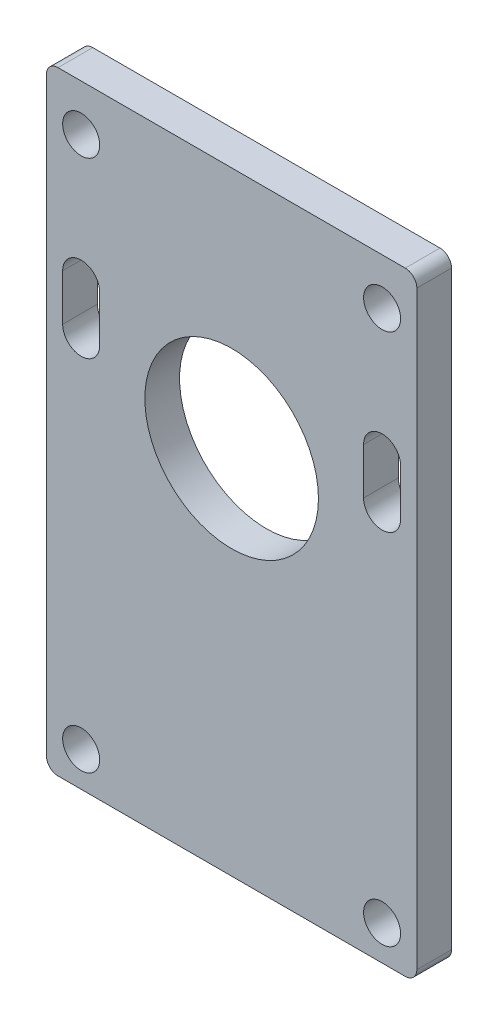
ISO-10303-21;
HEADER;
FILE_DESCRIPTION(('STEP AP214'),'2;1');
FILE_NAME('part.step','',(''),(''),'','','');
FILE_SCHEMA(('AUTOMOTIVE_DESIGN { 1 0 10303 214 1 1 1 1 }'));
ENDSEC;
DATA;
#1=APPLICATION_CONTEXT('core data for automotive mechanical design processes');
#2=APPLICATION_PROTOCOL_DEFINITION('international standard','automotive_design',2000,#1);
#3=PRODUCT_CONTEXT('',#1,'mechanical');
#4=PRODUCT('Part','Part','',(#3));
#5=PRODUCT_RELATED_PRODUCT_CATEGORY('part','',(#4));
#6=PRODUCT_DEFINITION_FORMATION('','',#4);
#7=PRODUCT_DEFINITION_CONTEXT('part definition',#1,'design');
#8=PRODUCT_DEFINITION('design','',#6,#7);
#9=PRODUCT_DEFINITION_SHAPE('','',#8);
#10=(LENGTH_UNIT() NAMED_UNIT(*) SI_UNIT(.MILLI.,.METRE.));
#11=(NAMED_UNIT(*) PLANE_ANGLE_UNIT() SI_UNIT($,.RADIAN.));
#12=(NAMED_UNIT(*) SI_UNIT($,.STERADIAN.) SOLID_ANGLE_UNIT());
#13=UNCERTAINTY_MEASURE_WITH_UNIT(LENGTH_MEASURE(1.E-05),#10,'distance_accuracy_value','');
#14=(GEOMETRIC_REPRESENTATION_CONTEXT(3) GLOBAL_UNCERTAINTY_ASSIGNED_CONTEXT((#13)) GLOBAL_UNIT_ASSIGNED_CONTEXT((#10,
#11,#12)) REPRESENTATION_CONTEXT('',''));
#15=CARTESIAN_POINT('',(0.,0.,0.));
#16=DIRECTION('',(0.,0.,1.));
#17=DIRECTION('',(1.,0.,0.));
#18=AXIS2_PLACEMENT_3D('',#15,#16,#17);
#19=CARTESIAN_POINT('',(0.,0.,3.));
#20=DIRECTION('',(1.,0.,0.));
#21=DIRECTION('',(0.,0.,-1.));
#22=AXIS2_PLACEMENT_3D('',#19,#20,#21);
#23=PLANE('',#22);
#24=DIRECTION('',(0.,-1.,0.));
#25=VECTOR('',#24,1.);
#26=CARTESIAN_POINT('',(0.,0.,0.));
#27=LINE('',#26,#25);
#28=CARTESIAN_POINT('',(0.,52.,0.));
#29=VERTEX_POINT('',#28);
#30=CARTESIAN_POINT('',(0.,1.,0.));
#31=VERTEX_POINT('',#30);
#32=EDGE_CURVE('E260',#29,#31,#27,.T.);
#33=ORIENTED_EDGE('',*,*,#32,.T.);
#34=DIRECTION('',(0.,0.,-1.));
#35=VECTOR('',#34,1.);
#36=CARTESIAN_POINT('',(0.,1.,3.));
#37=LINE('',#36,#35);
#38=CARTESIAN_POINT('',(0.,1.,3.));
#39=VERTEX_POINT('',#38);
#40=EDGE_CURVE('E341',#31,#39,#37,.F.);
#41=ORIENTED_EDGE('',*,*,#40,.T.);
#42=DIRECTION('',(0.,-1.,0.));
#43=VECTOR('',#42,1.);
#44=CARTESIAN_POINT('',(0.,0.,3.));
#45=LINE('',#44,#43);
#46=CARTESIAN_POINT('',(0.,52.,3.));
#47=VERTEX_POINT('',#46);
#48=EDGE_CURVE('E261',#47,#39,#45,.T.);
#49=ORIENTED_EDGE('',*,*,#48,.F.);
#50=DIRECTION('',(0.,0.,-1.));
#51=VECTOR('',#50,1.);
#52=CARTESIAN_POINT('',(0.,52.,3.));
#53=LINE('',#52,#51);
#54=EDGE_CURVE('E337',#47,#29,#53,.T.);
#55=ORIENTED_EDGE('',*,*,#54,.T.);
#56=EDGE_LOOP('',(#33,#41,#49,#55));
#57=FACE_BOUND('',#56,.T.);
#58=ADVANCED_FACE('F41',(#57),#23,.F.);
#59=CARTESIAN_POINT('',(0.,0.,3.));
#60=DIRECTION('',(0.,1.,0.));
#61=DIRECTION('',(0.,0.,1.));
#62=AXIS2_PLACEMENT_3D('',#59,#60,#61);
#63=PLANE('',#62);
#64=DIRECTION('',(1.,0.,0.));
#65=VECTOR('',#64,1.);
#66=CARTESIAN_POINT('',(0.,0.,0.));
#67=LINE('',#66,#65);
#68=CARTESIAN_POINT('',(1.,0.,0.));
#69=VERTEX_POINT('',#68);
#70=CARTESIAN_POINT('',(31.,0.,0.));
#71=VERTEX_POINT('',#70);
#72=EDGE_CURVE('E282',#69,#71,#67,.T.);
#73=ORIENTED_EDGE('',*,*,#72,.T.);
#74=DIRECTION('',(0.,0.,-1.));
#75=VECTOR('',#74,1.);
#76=CARTESIAN_POINT('',(31.,0.,3.));
#77=LINE('',#76,#75);
#78=CARTESIAN_POINT('',(31.,0.,3.));
#79=VERTEX_POINT('',#78);
#80=EDGE_CURVE('E315',#71,#79,#77,.F.);
#81=ORIENTED_EDGE('',*,*,#80,.T.);
#82=DIRECTION('',(1.,0.,0.));
#83=VECTOR('',#82,1.);
#84=CARTESIAN_POINT('',(0.,0.,3.));
#85=LINE('',#84,#83);
#86=CARTESIAN_POINT('',(1.,0.,3.));
#87=VERTEX_POINT('',#86);
#88=EDGE_CURVE('E265',#87,#79,#85,.T.);
#89=ORIENTED_EDGE('',*,*,#88,.F.);
#90=DIRECTION('',(0.,0.,-1.));
#91=VECTOR('',#90,1.);
#92=CARTESIAN_POINT('',(1.,0.,3.));
#93=LINE('',#92,#91);
#94=EDGE_CURVE('E311',#87,#69,#93,.T.);
#95=ORIENTED_EDGE('',*,*,#94,.T.);
#96=EDGE_LOOP('',(#73,#81,#89,#95));
#97=FACE_BOUND('',#96,.T.);
#98=ADVANCED_FACE('F386',(#97),#63,.F.);
#99=CARTESIAN_POINT('',(32.,0.,3.));
#100=DIRECTION('',(-1.,0.,0.));
#101=DIRECTION('',(0.,0.,1.));
#102=AXIS2_PLACEMENT_3D('',#99,#100,#101);
#103=PLANE('',#102);
#104=DIRECTION('',(0.,1.,0.));
#105=VECTOR('',#104,1.);
#106=CARTESIAN_POINT('',(32.,0.,3.));
#107=LINE('',#106,#105);
#108=CARTESIAN_POINT('',(32.,1.,3.));
#109=VERTEX_POINT('',#108);
#110=CARTESIAN_POINT('',(32.,52.,3.));
#111=VERTEX_POINT('',#110);
#112=EDGE_CURVE('E270',#109,#111,#107,.T.);
#113=ORIENTED_EDGE('',*,*,#112,.F.);
#114=DIRECTION('',(0.,0.,-1.));
#115=VECTOR('',#114,1.);
#116=CARTESIAN_POINT('',(32.,1.,3.));
#117=LINE('',#116,#115);
#118=CARTESIAN_POINT('',(32.,1.,0.));
#119=VERTEX_POINT('',#118);
#120=EDGE_CURVE('E295',#109,#119,#117,.T.);
#121=ORIENTED_EDGE('',*,*,#120,.T.);
#122=DIRECTION('',(0.,1.,0.));
#123=VECTOR('',#122,1.);
#124=CARTESIAN_POINT('',(32.,0.,0.));
#125=LINE('',#124,#123);
#126=CARTESIAN_POINT('',(32.,52.,0.));
#127=VERTEX_POINT('',#126);
#128=EDGE_CURVE('E286',#119,#127,#125,.T.);
#129=ORIENTED_EDGE('',*,*,#128,.T.);
#130=DIRECTION('',(0.,0.,-1.));
#131=VECTOR('',#130,1.);
#132=CARTESIAN_POINT('',(32.,52.,3.));
#133=LINE('',#132,#131);
#134=EDGE_CURVE('E278',#127,#111,#133,.F.);
#135=ORIENTED_EDGE('',*,*,#134,.T.);
#136=EDGE_LOOP('',(#113,#121,#129,#135));
#137=FACE_BOUND('',#136,.T.);
#138=ADVANCED_FACE('F392',(#137),#103,.F.);
#139=CARTESIAN_POINT('',(0.,53.,3.));
#140=DIRECTION('',(0.,-1.,0.));
#141=DIRECTION('',(0.,0.,-1.));
#142=AXIS2_PLACEMENT_3D('',#139,#140,#141);
#143=PLANE('',#142);
#144=DIRECTION('',(-1.,0.,0.));
#145=VECTOR('',#144,1.);
#146=CARTESIAN_POINT('',(0.,53.,3.));
#147=LINE('',#146,#145);
#148=CARTESIAN_POINT('',(31.,53.,3.));
#149=VERTEX_POINT('',#148);
#150=CARTESIAN_POINT('',(1.,53.,3.));
#151=VERTEX_POINT('',#150);
#152=EDGE_CURVE('E274',#149,#151,#147,.T.);
#153=ORIENTED_EDGE('',*,*,#152,.F.);
#154=DIRECTION('',(0.,0.,-1.));
#155=VECTOR('',#154,1.);
#156=CARTESIAN_POINT('',(31.,53.,3.));
#157=LINE('',#156,#155);
#158=CARTESIAN_POINT('',(31.,53.,0.));
#159=VERTEX_POINT('',#158);
#160=EDGE_CURVE('E333',#149,#159,#157,.T.);
#161=ORIENTED_EDGE('',*,*,#160,.T.);
#162=DIRECTION('',(-1.,0.,0.));
#163=VECTOR('',#162,1.);
#164=CARTESIAN_POINT('',(0.,53.,0.));
#165=LINE('',#164,#163);
#166=CARTESIAN_POINT('',(1.,53.,0.));
#167=VERTEX_POINT('',#166);
#168=EDGE_CURVE('E266',#159,#167,#165,.T.);
#169=ORIENTED_EDGE('',*,*,#168,.T.);
#170=DIRECTION('',(0.,0.,-1.));
#171=VECTOR('',#170,1.);
#172=CARTESIAN_POINT('',(1.,53.,3.));
#173=LINE('',#172,#171);
#174=EDGE_CURVE('E330',#167,#151,#173,.F.);
#175=ORIENTED_EDGE('',*,*,#174,.T.);
#176=EDGE_LOOP('',(#153,#161,#169,#175));
#177=FACE_BOUND('',#176,.T.);
#178=ADVANCED_FACE('F432',(#177),#143,.F.);
#179=CARTESIAN_POINT('',(0.,0.,3.));
#180=DIRECTION('',(0.,0.,-1.));
#181=DIRECTION('',(-1.,0.,0.));
#182=AXIS2_PLACEMENT_3D('',#179,#180,#181);
#183=PLANE('',#182);
#184=DIRECTION('',(0.,-1.,0.));
#185=VECTOR('',#184,1.);
#186=CARTESIAN_POINT('',(1.4,38.,3.));
#187=LINE('',#186,#185);
#188=CARTESIAN_POINT('',(1.4,38.,3.));
#189=VERTEX_POINT('',#188);
#190=CARTESIAN_POINT('',(1.4,34.,3.));
#191=VERTEX_POINT('',#190);
#192=EDGE_CURVE('E172',#189,#191,#187,.T.);
#193=ORIENTED_EDGE('',*,*,#192,.F.);
#194=CARTESIAN_POINT('',(3.,38.,3.));
#195=DIRECTION('',(0.,0.,1.));
#196=DIRECTION('',(1.,0.,0.));
#197=AXIS2_PLACEMENT_3D('',#194,#195,#196);
#198=CIRCLE('',#197,1.6);
#199=CARTESIAN_POINT('',(4.6,38.,3.));
#200=VERTEX_POINT('',#199);
#201=EDGE_CURVE('E57',#200,#189,#198,.T.);
#202=ORIENTED_EDGE('',*,*,#201,.F.);
#203=DIRECTION('',(0.,1.,0.));
#204=VECTOR('',#203,1.);
#205=CARTESIAN_POINT('',(4.6,38.,3.));
#206=LINE('',#205,#204);
#207=CARTESIAN_POINT('',(4.6,34.,3.));
#208=VERTEX_POINT('',#207);
#209=EDGE_CURVE('E180',#208,#200,#206,.T.);
#210=ORIENTED_EDGE('',*,*,#209,.F.);
#211=CARTESIAN_POINT('',(3.,34.,3.));
#212=DIRECTION('',(0.,0.,1.));
#213=DIRECTION('',(1.,0.,0.));
#214=AXIS2_PLACEMENT_3D('',#211,#212,#213);
#215=CIRCLE('',#214,1.6);
#216=EDGE_CURVE('E161',#191,#208,#215,.T.);
#217=ORIENTED_EDGE('',*,*,#216,.F.);
#218=EDGE_LOOP('',(#193,#202,#210,#217));
#219=FACE_BOUND('',#218,.T.);
#220=DIRECTION('',(0.,-1.,0.));
#221=VECTOR('',#220,1.);
#222=CARTESIAN_POINT('',(27.4,38.,3.));
#223=LINE('',#222,#221);
#224=CARTESIAN_POINT('',(27.4,38.,3.));
#225=VERTEX_POINT('',#224);
#226=CARTESIAN_POINT('',(27.4,34.,3.));
#227=VERTEX_POINT('',#226);
#228=EDGE_CURVE('E197',#225,#227,#223,.T.);
#229=ORIENTED_EDGE('',*,*,#228,.F.);
#230=CARTESIAN_POINT('',(29.,38.,3.));
#231=DIRECTION('',(0.,0.,1.));
#232=DIRECTION('',(-1.,0.,0.));
#233=AXIS2_PLACEMENT_3D('',#230,#231,#232);
#234=CIRCLE('',#233,1.6);
#235=CARTESIAN_POINT('',(30.6,38.,3.));
#236=VERTEX_POINT('',#235);
#237=EDGE_CURVE('E65',#236,#225,#234,.T.);
#238=ORIENTED_EDGE('',*,*,#237,.F.);
#239=DIRECTION('',(0.,1.,0.));
#240=VECTOR('',#239,1.);
#241=CARTESIAN_POINT('',(30.6,38.,3.));
#242=LINE('',#241,#240);
#243=CARTESIAN_POINT('',(30.6,34.,3.));
#244=VERTEX_POINT('',#243);
#245=EDGE_CURVE('E205',#244,#236,#242,.T.);
#246=ORIENTED_EDGE('',*,*,#245,.F.);
#247=CARTESIAN_POINT('',(29.,34.,3.));
#248=DIRECTION('',(0.,0.,1.));
#249=DIRECTION('',(-1.,0.,0.));
#250=AXIS2_PLACEMENT_3D('',#247,#248,#249);
#251=CIRCLE('',#250,1.6);
#252=EDGE_CURVE('E201',#227,#244,#251,.T.);
#253=ORIENTED_EDGE('',*,*,#252,.F.);
#254=EDGE_LOOP('',(#229,#238,#246,#253));
#255=FACE_BOUND('',#254,.T.);
#256=CARTESIAN_POINT('',(16.,32.,3.));
#257=DIRECTION('',(0.,0.,1.));
#258=DIRECTION('',(1.,0.,0.));
#259=AXIS2_PLACEMENT_3D('',#256,#257,#258);
#260=CIRCLE('',#259,7.5);
#261=CARTESIAN_POINT('',(23.5,32.,3.));
#262=VERTEX_POINT('',#261);
#263=EDGE_CURVE('E190',#262,#262,#260,.T.);
#264=ORIENTED_EDGE('',*,*,#263,.F.);
#265=EDGE_LOOP('',(#264));
#266=FACE_BOUND('',#265,.T.);
#267=CARTESIAN_POINT('',(3.,49.,3.));
#268=DIRECTION('',(0.,0.,1.));
#269=DIRECTION('',(1.,0.,0.));
#270=AXIS2_PLACEMENT_3D('',#267,#268,#269);
#271=CIRCLE('',#270,1.6);
#272=CARTESIAN_POINT('',(4.6,49.,3.));
#273=VERTEX_POINT('',#272);
#274=EDGE_CURVE('E225',#273,#273,#271,.T.);
#275=ORIENTED_EDGE('',*,*,#274,.F.);
#276=EDGE_LOOP('',(#275));
#277=FACE_BOUND('',#276,.T.);
#278=CARTESIAN_POINT('',(3.,3.,3.));
#279=DIRECTION('',(0.,0.,1.));
#280=DIRECTION('',(1.,0.,0.));
#281=AXIS2_PLACEMENT_3D('',#278,#279,#280);
#282=CIRCLE('',#281,1.6);
#283=CARTESIAN_POINT('',(4.6,3.,3.));
#284=VERTEX_POINT('',#283);
#285=EDGE_CURVE('E236',#284,#284,#282,.T.);
#286=ORIENTED_EDGE('',*,*,#285,.F.);
#287=EDGE_LOOP('',(#286));
#288=FACE_BOUND('',#287,.T.);
#289=CARTESIAN_POINT('',(29.,49.,3.));
#290=DIRECTION('',(0.,0.,1.));
#291=DIRECTION('',(1.,0.,0.));
#292=AXIS2_PLACEMENT_3D('',#289,#290,#291);
#293=CIRCLE('',#292,1.6);
#294=CARTESIAN_POINT('',(30.6,49.,3.));
#295=VERTEX_POINT('',#294);
#296=EDGE_CURVE('E244',#295,#295,#293,.T.);
#297=ORIENTED_EDGE('',*,*,#296,.F.);
#298=EDGE_LOOP('',(#297));
#299=FACE_BOUND('',#298,.T.);
#300=CARTESIAN_POINT('',(29.,3.,3.));
#301=DIRECTION('',(0.,0.,1.));
#302=DIRECTION('',(1.,0.,0.));
#303=AXIS2_PLACEMENT_3D('',#300,#301,#302);
#304=CIRCLE('',#303,1.6);
#305=CARTESIAN_POINT('',(30.6,3.,3.));
#306=VERTEX_POINT('',#305);
#307=EDGE_CURVE('E252',#306,#306,#304,.T.);
#308=ORIENTED_EDGE('',*,*,#307,.F.);
#309=EDGE_LOOP('',(#308));
#310=FACE_BOUND('',#309,.T.);
#311=ORIENTED_EDGE('',*,*,#88,.T.);
#312=CARTESIAN_POINT('',(31.,1.,3.));
#313=DIRECTION('',(0.,0.,-1.));
#314=DIRECTION('',(-1.,0.,0.));
#315=AXIS2_PLACEMENT_3D('',#312,#313,#314);
#316=CIRCLE('',#315,1.);
#317=EDGE_CURVE('E327',#79,#109,#316,.F.);
#318=ORIENTED_EDGE('',*,*,#317,.T.);
#319=ORIENTED_EDGE('',*,*,#112,.T.);
#320=CARTESIAN_POINT('',(31.,52.,3.));
#321=DIRECTION('',(0.,0.,-1.));
#322=DIRECTION('',(-1.,0.,0.));
#323=AXIS2_PLACEMENT_3D('',#320,#321,#322);
#324=CIRCLE('',#323,1.);
#325=EDGE_CURVE('E324',#111,#149,#324,.F.);
#326=ORIENTED_EDGE('',*,*,#325,.T.);
#327=ORIENTED_EDGE('',*,*,#152,.T.);
#328=CARTESIAN_POINT('',(1.,52.,3.));
#329=DIRECTION('',(0.,0.,-1.));
#330=DIRECTION('',(-1.,0.,0.));
#331=AXIS2_PLACEMENT_3D('',#328,#329,#330);
#332=CIRCLE('',#331,1.);
#333=EDGE_CURVE('E318',#151,#47,#332,.F.);
#334=ORIENTED_EDGE('',*,*,#333,.T.);
#335=ORIENTED_EDGE('',*,*,#48,.T.);
#336=CARTESIAN_POINT('',(1.,1.,3.));
#337=DIRECTION('',(0.,0.,-1.));
#338=DIRECTION('',(-1.,0.,0.));
#339=AXIS2_PLACEMENT_3D('',#336,#337,#338);
#340=CIRCLE('',#339,1.);
#341=EDGE_CURVE('E321',#39,#87,#340,.F.);
#342=ORIENTED_EDGE('',*,*,#341,.T.);
#343=EDGE_LOOP('',(#311,#318,#319,#326,#327,#334,#335,#342));
#344=FACE_BOUND('',#343,.T.);
#345=ADVANCED_FACE('F177',(#219,#255,#266,#277,#288,#299,#310,#344),#183,.F.);
#346=CARTESIAN_POINT('',(0.,0.,0.));
#347=DIRECTION('',(0.,0.,-1.));
#348=DIRECTION('',(-1.,0.,0.));
#349=AXIS2_PLACEMENT_3D('',#346,#347,#348);
#350=PLANE('',#349);
#351=CARTESIAN_POINT('',(3.,38.,0.));
#352=DIRECTION('',(0.,0.,-1.));
#353=DIRECTION('',(-1.,0.,0.));
#354=AXIS2_PLACEMENT_3D('',#351,#352,#353);
#355=CIRCLE('',#354,1.6);
#356=CARTESIAN_POINT('',(1.4,38.,0.));
#357=VERTEX_POINT('',#356);
#358=CARTESIAN_POINT('',(4.6,38.,0.));
#359=VERTEX_POINT('',#358);
#360=EDGE_CURVE('E11',#357,#359,#355,.T.);
#361=ORIENTED_EDGE('',*,*,#360,.F.);
#362=DIRECTION('',(0.,1.,0.));
#363=VECTOR('',#362,1.);
#364=CARTESIAN_POINT('',(1.40000000000001,0.,0.));
#365=LINE('',#364,#363);
#366=CARTESIAN_POINT('',(1.4,34.,0.));
#367=VERTEX_POINT('',#366);
#368=EDGE_CURVE('E357',#367,#357,#365,.T.);
#369=ORIENTED_EDGE('',*,*,#368,.F.);
#370=CARTESIAN_POINT('',(3.,34.,0.));
#371=DIRECTION('',(0.,0.,-1.));
#372=DIRECTION('',(-1.,0.,0.));
#373=AXIS2_PLACEMENT_3D('',#370,#371,#372);
#374=CIRCLE('',#373,1.6);
#375=CARTESIAN_POINT('',(4.6,34.,0.));
#376=VERTEX_POINT('',#375);
#377=EDGE_CURVE('E164',#376,#367,#374,.T.);
#378=ORIENTED_EDGE('',*,*,#377,.F.);
#379=DIRECTION('',(0.,-1.,0.));
#380=VECTOR('',#379,1.);
#381=CARTESIAN_POINT('',(4.6,0.,0.));
#382=LINE('',#381,#380);
#383=EDGE_CURVE('E50',#359,#376,#382,.T.);
#384=ORIENTED_EDGE('',*,*,#383,.F.);
#385=EDGE_LOOP('',(#361,#369,#378,#384));
#386=FACE_BOUND('',#385,.T.);
#387=CARTESIAN_POINT('',(29.,38.,0.));
#388=DIRECTION('',(0.,0.,-1.));
#389=DIRECTION('',(-1.,0.,0.));
#390=AXIS2_PLACEMENT_3D('',#387,#388,#389);
#391=CIRCLE('',#390,1.6);
#392=CARTESIAN_POINT('',(27.4,38.,0.));
#393=VERTEX_POINT('',#392);
#394=CARTESIAN_POINT('',(30.6,38.,0.));
#395=VERTEX_POINT('',#394);
#396=EDGE_CURVE('E354',#393,#395,#391,.T.);
#397=ORIENTED_EDGE('',*,*,#396,.F.);
#398=DIRECTION('',(0.,1.,0.));
#399=VECTOR('',#398,1.);
#400=CARTESIAN_POINT('',(27.4,0.,0.));
#401=LINE('',#400,#399);
#402=CARTESIAN_POINT('',(27.4,34.,0.));
#403=VERTEX_POINT('',#402);
#404=EDGE_CURVE('E344',#403,#393,#401,.T.);
#405=ORIENTED_EDGE('',*,*,#404,.F.);
#406=CARTESIAN_POINT('',(29.,34.,0.));
#407=DIRECTION('',(0.,0.,-1.));
#408=DIRECTION('',(-1.,0.,0.));
#409=AXIS2_PLACEMENT_3D('',#406,#407,#408);
#410=CIRCLE('',#409,1.6);
#411=CARTESIAN_POINT('',(30.6,34.,0.));
#412=VERTEX_POINT('',#411);
#413=EDGE_CURVE('E347',#412,#403,#410,.T.);
#414=ORIENTED_EDGE('',*,*,#413,.F.);
#415=DIRECTION('',(0.,-1.,0.));
#416=VECTOR('',#415,1.);
#417=CARTESIAN_POINT('',(30.6,0.,0.));
#418=LINE('',#417,#416);
#419=EDGE_CURVE('E351',#395,#412,#418,.T.);
#420=ORIENTED_EDGE('',*,*,#419,.F.);
#421=EDGE_LOOP('',(#397,#405,#414,#420));
#422=FACE_BOUND('',#421,.T.);
#423=CARTESIAN_POINT('',(16.,32.,0.));
#424=DIRECTION('',(0.,0.,1.));
#425=DIRECTION('',(1.,0.,0.));
#426=AXIS2_PLACEMENT_3D('',#423,#424,#425);
#427=CIRCLE('',#426,7.5);
#428=CARTESIAN_POINT('',(23.5,32.,0.));
#429=VERTEX_POINT('',#428);
#430=EDGE_CURVE('E221',#429,#429,#427,.T.);
#431=ORIENTED_EDGE('',*,*,#430,.T.);
#432=EDGE_LOOP('',(#431));
#433=FACE_BOUND('',#432,.T.);
#434=CARTESIAN_POINT('',(3.,49.,0.));
#435=DIRECTION('',(0.,0.,1.));
#436=DIRECTION('',(1.,0.,0.));
#437=AXIS2_PLACEMENT_3D('',#434,#435,#436);
#438=CIRCLE('',#437,1.6);
#439=CARTESIAN_POINT('',(4.6,49.,0.));
#440=VERTEX_POINT('',#439);
#441=EDGE_CURVE('E232',#440,#440,#438,.T.);
#442=ORIENTED_EDGE('',*,*,#441,.T.);
#443=EDGE_LOOP('',(#442));
#444=FACE_BOUND('',#443,.T.);
#445=CARTESIAN_POINT('',(3.,3.,0.));
#446=DIRECTION('',(0.,0.,1.));
#447=DIRECTION('',(1.,0.,0.));
#448=AXIS2_PLACEMENT_3D('',#445,#446,#447);
#449=CIRCLE('',#448,1.6);
#450=CARTESIAN_POINT('',(4.6,3.,0.));
#451=VERTEX_POINT('',#450);
#452=EDGE_CURVE('E240',#451,#451,#449,.T.);
#453=ORIENTED_EDGE('',*,*,#452,.T.);
#454=EDGE_LOOP('',(#453));
#455=FACE_BOUND('',#454,.T.);
#456=CARTESIAN_POINT('',(29.,49.,0.));
#457=DIRECTION('',(0.,0.,1.));
#458=DIRECTION('',(1.,0.,0.));
#459=AXIS2_PLACEMENT_3D('',#456,#457,#458);
#460=CIRCLE('',#459,1.6);
#461=CARTESIAN_POINT('',(30.6,49.,0.));
#462=VERTEX_POINT('',#461);
#463=EDGE_CURVE('E248',#462,#462,#460,.T.);
#464=ORIENTED_EDGE('',*,*,#463,.T.);
#465=EDGE_LOOP('',(#464));
#466=FACE_BOUND('',#465,.T.);
#467=CARTESIAN_POINT('',(29.,3.,0.));
#468=DIRECTION('',(0.,0.,1.));
#469=DIRECTION('',(1.,0.,0.));
#470=AXIS2_PLACEMENT_3D('',#467,#468,#469);
#471=CIRCLE('',#470,1.6);
#472=CARTESIAN_POINT('',(30.6,3.,0.));
#473=VERTEX_POINT('',#472);
#474=EDGE_CURVE('E256',#473,#473,#471,.T.);
#475=ORIENTED_EDGE('',*,*,#474,.T.);
#476=EDGE_LOOP('',(#475));
#477=FACE_BOUND('',#476,.T.);
#478=ORIENTED_EDGE('',*,*,#128,.F.);
#479=CARTESIAN_POINT('',(31.,1.,0.));
#480=DIRECTION('',(0.,0.,-1.));
#481=DIRECTION('',(-1.,0.,0.));
#482=AXIS2_PLACEMENT_3D('',#479,#480,#481);
#483=CIRCLE('',#482,1.);
#484=EDGE_CURVE('E308',#119,#71,#483,.T.);
#485=ORIENTED_EDGE('',*,*,#484,.T.);
#486=ORIENTED_EDGE('',*,*,#72,.F.);
#487=CARTESIAN_POINT('',(1.,1.,0.));
#488=DIRECTION('',(0.,0.,-1.));
#489=DIRECTION('',(-1.,0.,0.));
#490=AXIS2_PLACEMENT_3D('',#487,#488,#489);
#491=CIRCLE('',#490,1.);
#492=EDGE_CURVE('E302',#69,#31,#491,.T.);
#493=ORIENTED_EDGE('',*,*,#492,.T.);
#494=ORIENTED_EDGE('',*,*,#32,.F.);
#495=CARTESIAN_POINT('',(1.,52.,0.));
#496=DIRECTION('',(0.,0.,-1.));
#497=DIRECTION('',(-1.,0.,0.));
#498=AXIS2_PLACEMENT_3D('',#495,#496,#497);
#499=CIRCLE('',#498,1.);
#500=EDGE_CURVE('E299',#29,#167,#499,.T.);
#501=ORIENTED_EDGE('',*,*,#500,.T.);
#502=ORIENTED_EDGE('',*,*,#168,.F.);
#503=CARTESIAN_POINT('',(31.,52.,0.));
#504=DIRECTION('',(0.,0.,-1.));
#505=DIRECTION('',(-1.,0.,0.));
#506=AXIS2_PLACEMENT_3D('',#503,#504,#505);
#507=CIRCLE('',#506,1.);
#508=EDGE_CURVE('E305',#159,#127,#507,.T.);
#509=ORIENTED_EDGE('',*,*,#508,.T.);
#510=EDGE_LOOP('',(#478,#485,#486,#493,#494,#501,#502,#509));
#511=FACE_BOUND('',#510,.T.);
#512=ADVANCED_FACE('F368',(#386,#422,#433,#444,#455,#466,#477,#511),#350,.T.);
#513=CARTESIAN_POINT('',(29.,3.,3.));
#514=DIRECTION('',(0.,0.,1.));
#515=DIRECTION('',(1.,0.,0.));
#516=AXIS2_PLACEMENT_3D('',#513,#514,#515);
#517=CYLINDRICAL_SURFACE('',#516,1.6);
#518=ORIENTED_EDGE('',*,*,#474,.F.);
#519=EDGE_LOOP('',(#518));
#520=FACE_BOUND('',#519,.T.);
#521=ORIENTED_EDGE('',*,*,#307,.T.);
#522=EDGE_LOOP('',(#521));
#523=FACE_BOUND('',#522,.T.);
#524=ADVANCED_FACE('F439',(#520,#523),#517,.F.);
#525=CARTESIAN_POINT('',(29.,49.,3.));
#526=DIRECTION('',(0.,0.,1.));
#527=DIRECTION('',(1.,0.,0.));
#528=AXIS2_PLACEMENT_3D('',#525,#526,#527);
#529=CYLINDRICAL_SURFACE('',#528,1.6);
#530=ORIENTED_EDGE('',*,*,#463,.F.);
#531=EDGE_LOOP('',(#530));
#532=FACE_BOUND('',#531,.T.);
#533=ORIENTED_EDGE('',*,*,#296,.T.);
#534=EDGE_LOOP('',(#533));
#535=FACE_BOUND('',#534,.T.);
#536=ADVANCED_FACE('F445',(#532,#535),#529,.F.);
#537=CARTESIAN_POINT('',(3.,3.,3.));
#538=DIRECTION('',(0.,0.,1.));
#539=DIRECTION('',(1.,0.,0.));
#540=AXIS2_PLACEMENT_3D('',#537,#538,#539);
#541=CYLINDRICAL_SURFACE('',#540,1.6);
#542=ORIENTED_EDGE('',*,*,#452,.F.);
#543=EDGE_LOOP('',(#542));
#544=FACE_BOUND('',#543,.T.);
#545=ORIENTED_EDGE('',*,*,#285,.T.);
#546=EDGE_LOOP('',(#545));
#547=FACE_BOUND('',#546,.T.);
#548=ADVANCED_FACE('F542',(#544,#547),#541,.F.);
#549=CARTESIAN_POINT('',(3.,49.,3.));
#550=DIRECTION('',(0.,0.,1.));
#551=DIRECTION('',(1.,0.,0.));
#552=AXIS2_PLACEMENT_3D('',#549,#550,#551);
#553=CYLINDRICAL_SURFACE('',#552,1.6);
#554=ORIENTED_EDGE('',*,*,#441,.F.);
#555=EDGE_LOOP('',(#554));
#556=FACE_BOUND('',#555,.T.);
#557=ORIENTED_EDGE('',*,*,#274,.T.);
#558=EDGE_LOOP('',(#557));
#559=FACE_BOUND('',#558,.T.);
#560=ADVANCED_FACE('F401',(#556,#559),#553,.F.);
#561=CARTESIAN_POINT('',(31.,1.,3.));
#562=DIRECTION('',(0.,0.,-1.));
#563=DIRECTION('',(-1.,0.,0.));
#564=AXIS2_PLACEMENT_3D('',#561,#562,#563);
#565=CYLINDRICAL_SURFACE('',#564,1.);
#566=ORIENTED_EDGE('',*,*,#317,.F.);
#567=ORIENTED_EDGE('',*,*,#80,.F.);
#568=ORIENTED_EDGE('',*,*,#484,.F.);
#569=ORIENTED_EDGE('',*,*,#120,.F.);
#570=EDGE_LOOP('',(#566,#567,#568,#569));
#571=FACE_BOUND('',#570,.T.);
#572=ADVANCED_FACE('F397',(#571),#565,.T.);
#573=CARTESIAN_POINT('',(31.,52.,3.));
#574=DIRECTION('',(0.,0.,-1.));
#575=DIRECTION('',(-1.,0.,0.));
#576=AXIS2_PLACEMENT_3D('',#573,#574,#575);
#577=CYLINDRICAL_SURFACE('',#576,1.);
#578=ORIENTED_EDGE('',*,*,#325,.F.);
#579=ORIENTED_EDGE('',*,*,#134,.F.);
#580=ORIENTED_EDGE('',*,*,#508,.F.);
#581=ORIENTED_EDGE('',*,*,#160,.F.);
#582=EDGE_LOOP('',(#578,#579,#580,#581));
#583=FACE_BOUND('',#582,.T.);
#584=ADVANCED_FACE('F400',(#583),#577,.T.);
#585=CARTESIAN_POINT('',(1.,1.,3.));
#586=DIRECTION('',(0.,0.,-1.));
#587=DIRECTION('',(-1.,0.,0.));
#588=AXIS2_PLACEMENT_3D('',#585,#586,#587);
#589=CYLINDRICAL_SURFACE('',#588,1.);
#590=ORIENTED_EDGE('',*,*,#341,.F.);
#591=ORIENTED_EDGE('',*,*,#40,.F.);
#592=ORIENTED_EDGE('',*,*,#492,.F.);
#593=ORIENTED_EDGE('',*,*,#94,.F.);
#594=EDGE_LOOP('',(#590,#591,#592,#593));
#595=FACE_BOUND('',#594,.T.);
#596=ADVANCED_FACE('F404',(#595),#589,.T.);
#597=CARTESIAN_POINT('',(1.,52.,3.));
#598=DIRECTION('',(0.,0.,-1.));
#599=DIRECTION('',(-1.,0.,0.));
#600=AXIS2_PLACEMENT_3D('',#597,#598,#599);
#601=CYLINDRICAL_SURFACE('',#600,1.);
#602=ORIENTED_EDGE('',*,*,#333,.F.);
#603=ORIENTED_EDGE('',*,*,#174,.F.);
#604=ORIENTED_EDGE('',*,*,#500,.F.);
#605=ORIENTED_EDGE('',*,*,#54,.F.);
#606=EDGE_LOOP('',(#602,#603,#604,#605));
#607=FACE_BOUND('',#606,.T.);
#608=ADVANCED_FACE('F43',(#607),#601,.T.);
#609=CARTESIAN_POINT('',(16.,32.,0.));
#610=DIRECTION('',(0.,0.,1.));
#611=DIRECTION('',(1.,0.,0.));
#612=AXIS2_PLACEMENT_3D('',#609,#610,#611);
#613=CYLINDRICAL_SURFACE('',#612,7.5);
#614=ORIENTED_EDGE('',*,*,#430,.F.);
#615=EDGE_LOOP('',(#614));
#616=FACE_BOUND('',#615,.T.);
#617=ORIENTED_EDGE('',*,*,#263,.T.);
#618=EDGE_LOOP('',(#617));
#619=FACE_BOUND('',#618,.T.);
#620=ADVANCED_FACE('F411',(#616,#619),#613,.F.);
#621=CARTESIAN_POINT('',(29.,38.,-57.));
#622=DIRECTION('',(0.,0.,1.));
#623=DIRECTION('',(1.,0.,0.));
#624=AXIS2_PLACEMENT_3D('',#621,#622,#623);
#625=CYLINDRICAL_SURFACE('',#624,1.6);
#626=ORIENTED_EDGE('',*,*,#396,.T.);
#627=DIRECTION('',(0.,0.,1.));
#628=VECTOR('',#627,1.);
#629=CARTESIAN_POINT('',(30.6,38.,-57.));
#630=LINE('',#629,#628);
#631=EDGE_CURVE('E210',#395,#236,#630,.T.);
#632=ORIENTED_EDGE('',*,*,#631,.T.);
#633=ORIENTED_EDGE('',*,*,#237,.T.);
#634=DIRECTION('',(0.,0.,1.));
#635=VECTOR('',#634,1.);
#636=CARTESIAN_POINT('',(27.4,38.,-57.));
#637=LINE('',#636,#635);
#638=EDGE_CURVE('E209',#393,#225,#637,.T.);
#639=ORIENTED_EDGE('',*,*,#638,.F.);
#640=EDGE_LOOP('',(#626,#632,#633,#639));
#641=FACE_BOUND('',#640,.T.);
#642=ADVANCED_FACE('F480',(#641),#625,.F.);
#643=CARTESIAN_POINT('',(30.6,38.,-57.));
#644=DIRECTION('',(1.,0.,0.));
#645=DIRECTION('',(0.,0.,-1.));
#646=AXIS2_PLACEMENT_3D('',#643,#644,#645);
#647=PLANE('',#646);
#648=ORIENTED_EDGE('',*,*,#419,.T.);
#649=DIRECTION('',(0.,0.,1.));
#650=VECTOR('',#649,1.);
#651=CARTESIAN_POINT('',(30.6,34.,-57.));
#652=LINE('',#651,#650);
#653=EDGE_CURVE('E213',#412,#244,#652,.T.);
#654=ORIENTED_EDGE('',*,*,#653,.T.);
#655=ORIENTED_EDGE('',*,*,#245,.T.);
#656=ORIENTED_EDGE('',*,*,#631,.F.);
#657=EDGE_LOOP('',(#648,#654,#655,#656));
#658=FACE_BOUND('',#657,.T.);
#659=ADVANCED_FACE('F485',(#658),#647,.F.);
#660=CARTESIAN_POINT('',(29.,34.,-57.));
#661=DIRECTION('',(0.,0.,1.));
#662=DIRECTION('',(1.,0.,0.));
#663=AXIS2_PLACEMENT_3D('',#660,#661,#662);
#664=CYLINDRICAL_SURFACE('',#663,1.6);
#665=ORIENTED_EDGE('',*,*,#413,.T.);
#666=DIRECTION('',(0.,0.,1.));
#667=VECTOR('',#666,1.);
#668=CARTESIAN_POINT('',(27.4,34.,-57.));
#669=LINE('',#668,#667);
#670=EDGE_CURVE('E216',#403,#227,#669,.T.);
#671=ORIENTED_EDGE('',*,*,#670,.T.);
#672=ORIENTED_EDGE('',*,*,#252,.T.);
#673=ORIENTED_EDGE('',*,*,#653,.F.);
#674=EDGE_LOOP('',(#665,#671,#672,#673));
#675=FACE_BOUND('',#674,.T.);
#676=ADVANCED_FACE('F380',(#675),#664,.F.);
#677=CARTESIAN_POINT('',(27.4,38.,-57.));
#678=DIRECTION('',(-1.,0.,0.));
#679=DIRECTION('',(0.,0.,1.));
#680=AXIS2_PLACEMENT_3D('',#677,#678,#679);
#681=PLANE('',#680);
#682=ORIENTED_EDGE('',*,*,#404,.T.);
#683=ORIENTED_EDGE('',*,*,#638,.T.);
#684=ORIENTED_EDGE('',*,*,#228,.T.);
#685=ORIENTED_EDGE('',*,*,#670,.F.);
#686=EDGE_LOOP('',(#682,#683,#684,#685));
#687=FACE_BOUND('',#686,.T.);
#688=ADVANCED_FACE('F373',(#687),#681,.F.);
#689=CARTESIAN_POINT('',(3.,38.,-57.));
#690=DIRECTION('',(0.,0.,1.));
#691=DIRECTION('',(1.,0.,0.));
#692=AXIS2_PLACEMENT_3D('',#689,#690,#691);
#693=CYLINDRICAL_SURFACE('',#692,1.6);
#694=ORIENTED_EDGE('',*,*,#360,.T.);
#695=DIRECTION('',(0.,0.,1.));
#696=VECTOR('',#695,1.);
#697=CARTESIAN_POINT('',(4.6,38.,-57.));
#698=LINE('',#697,#696);
#699=EDGE_CURVE('E187',#359,#200,#698,.T.);
#700=ORIENTED_EDGE('',*,*,#699,.T.);
#701=ORIENTED_EDGE('',*,*,#201,.T.);
#702=DIRECTION('',(0.,0.,1.));
#703=VECTOR('',#702,1.);
#704=CARTESIAN_POINT('',(1.4,38.,-57.));
#705=LINE('',#704,#703);
#706=EDGE_CURVE('E169',#357,#189,#705,.T.);
#707=ORIENTED_EDGE('',*,*,#706,.F.);
#708=EDGE_LOOP('',(#694,#700,#701,#707));
#709=FACE_BOUND('',#708,.T.);
#710=ADVANCED_FACE('F370',(#709),#693,.F.);
#711=CARTESIAN_POINT('',(4.6,38.,-57.));
#712=DIRECTION('',(1.,0.,0.));
#713=DIRECTION('',(0.,0.,-1.));
#714=AXIS2_PLACEMENT_3D('',#711,#712,#713);
#715=PLANE('',#714);
#716=ORIENTED_EDGE('',*,*,#383,.T.);
#717=DIRECTION('',(0.,0.,1.));
#718=VECTOR('',#717,1.);
#719=CARTESIAN_POINT('',(4.6,34.,-57.));
#720=LINE('',#719,#718);
#721=EDGE_CURVE('E168',#376,#208,#720,.T.);
#722=ORIENTED_EDGE('',*,*,#721,.T.);
#723=ORIENTED_EDGE('',*,*,#209,.T.);
#724=ORIENTED_EDGE('',*,*,#699,.F.);
#725=EDGE_LOOP('',(#716,#722,#723,#724));
#726=FACE_BOUND('',#725,.T.);
#727=ADVANCED_FACE('F365',(#726),#715,.F.);
#728=CARTESIAN_POINT('',(3.,34.,-57.));
#729=DIRECTION('',(0.,0.,1.));
#730=DIRECTION('',(1.,0.,0.));
#731=AXIS2_PLACEMENT_3D('',#728,#729,#730);
#732=CYLINDRICAL_SURFACE('',#731,1.6);
#733=ORIENTED_EDGE('',*,*,#377,.T.);
#734=DIRECTION('',(0.,0.,1.));
#735=VECTOR('',#734,1.);
#736=CARTESIAN_POINT('',(1.4,34.,-57.));
#737=LINE('',#736,#735);
#738=EDGE_CURVE('E156',#367,#191,#737,.T.);
#739=ORIENTED_EDGE('',*,*,#738,.T.);
#740=ORIENTED_EDGE('',*,*,#216,.T.);
#741=ORIENTED_EDGE('',*,*,#721,.F.);
#742=EDGE_LOOP('',(#733,#739,#740,#741));
#743=FACE_BOUND('',#742,.T.);
#744=ADVANCED_FACE('F158',(#743),#732,.F.);
#745=CARTESIAN_POINT('',(1.4,38.,-57.));
#746=DIRECTION('',(-1.,0.,0.));
#747=DIRECTION('',(0.,-1.,0.));
#748=AXIS2_PLACEMENT_3D('',#745,#746,#747);
#749=PLANE('',#748);
#750=ORIENTED_EDGE('',*,*,#368,.T.);
#751=ORIENTED_EDGE('',*,*,#706,.T.);
#752=ORIENTED_EDGE('',*,*,#192,.T.);
#753=ORIENTED_EDGE('',*,*,#738,.F.);
#754=EDGE_LOOP('',(#750,#751,#752,#753));
#755=FACE_BOUND('',#754,.T.);
#756=ADVANCED_FACE('F173',(#755),#749,.F.);
#757=CLOSED_SHELL('',(#58,#98,#138,#178,#345,#512,#524,#536,#548,#560,#572,#584,#596,#608,#620,
#642,#659,#676,#688,#710,#727,#744,#756));
#758=MANIFOLD_SOLID_BREP('B2',#757);
#759=ADVANCED_BREP_SHAPE_REPRESENTATION('',(#18,#758),#14);
#760=SHAPE_DEFINITION_REPRESENTATION(#9,#759);
ENDSEC;
END-ISO-10303-21;
